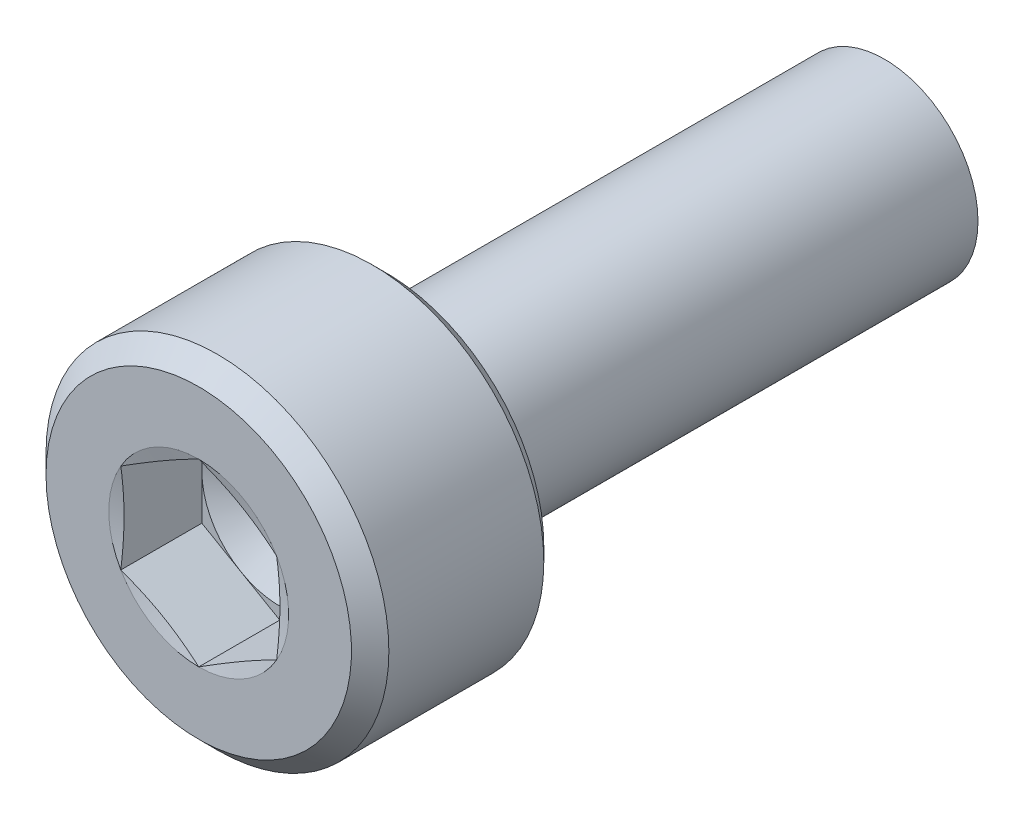
ISO-10303-21;
HEADER;
FILE_DESCRIPTION(('STEP AP214'),'2;1');
FILE_NAME('part.step','',(''),(''),'','','');
FILE_SCHEMA(('AUTOMOTIVE_DESIGN { 1 0 10303 214 1 1 1 1 }'));
ENDSEC;
DATA;
#1=APPLICATION_CONTEXT('core data for automotive mechanical design processes');
#2=APPLICATION_PROTOCOL_DEFINITION('international standard','automotive_design',2000,#1);
#3=PRODUCT_CONTEXT('',#1,'mechanical');
#4=PRODUCT('Part','Part','',(#3));
#5=PRODUCT_RELATED_PRODUCT_CATEGORY('part','',(#4));
#6=PRODUCT_DEFINITION_FORMATION('','',#4);
#7=PRODUCT_DEFINITION_CONTEXT('part definition',#1,'design');
#8=PRODUCT_DEFINITION('design','',#6,#7);
#9=PRODUCT_DEFINITION_SHAPE('','',#8);
#10=(LENGTH_UNIT() NAMED_UNIT(*) SI_UNIT(.MILLI.,.METRE.));
#11=(NAMED_UNIT(*) PLANE_ANGLE_UNIT() SI_UNIT($,.RADIAN.));
#12=(NAMED_UNIT(*) SI_UNIT($,.STERADIAN.) SOLID_ANGLE_UNIT());
#13=UNCERTAINTY_MEASURE_WITH_UNIT(LENGTH_MEASURE(1.E-05),#10,'distance_accuracy_value','');
#14=(GEOMETRIC_REPRESENTATION_CONTEXT(3) GLOBAL_UNCERTAINTY_ASSIGNED_CONTEXT((#13)) GLOBAL_UNIT_ASSIGNED_CONTEXT((#10,
#11,#12)) REPRESENTATION_CONTEXT('',''));
#15=CARTESIAN_POINT('',(0.,0.,0.));
#16=DIRECTION('',(0.,0.,1.));
#17=DIRECTION('',(1.,0.,0.));
#18=AXIS2_PLACEMENT_3D('',#15,#16,#17);
#19=CARTESIAN_POINT('',(1.25,0.721687836487033,-1.3));
#20=DIRECTION('',(0.5,0.866025403784439,0.));
#21=DIRECTION('',(0.,0.,-1.));
#22=AXIS2_PLACEMENT_3D('',#19,#20,#21);
#23=PLANE('',#22);
#24=CARTESIAN_POINT('',(0.,1.44337567297407,0.));
#25=CARTESIAN_POINT('',(0.0266010741574035,1.42801550344856,-0.00411563079121512));
#26=CARTESIAN_POINT('',(0.0532235716252887,1.41263958063488,-0.00803870308418439));
#27=CARTESIAN_POINT('',(0.105990950310015,1.38216656964672,-0.0153837682666469));
#28=CARTESIAN_POINT('',(0.132134938423043,1.36706993862756,-0.0188140917976724));
#29=CARTESIAN_POINT('',(0.184080896535333,1.33708618540438,-0.025174957981675));
#30=CARTESIAN_POINT('',(0.209882172940569,1.32219928511393,-0.0281121725270214));
#31=CARTESIAN_POINT('',(0.261290419336476,1.29254695927157,-0.0334872092687405));
#32=CARTESIAN_POINT('',(0.286897013202713,1.27778166527025,-0.0359293451582305));
#33=CARTESIAN_POINT('',(0.338814014231531,1.24779551622449,-0.0403875802559015));
#34=CARTESIAN_POINT('',(0.365124701320746,1.23257315304511,-0.0423903504078004));
#35=CARTESIAN_POINT('',(0.41739626342825,1.20233457949772,-0.0458161323987716));
#36=CARTESIAN_POINT('',(0.443356722749427,1.18731855544823,-0.0472470738867774));
#37=CARTESIAN_POINT('',(0.495189289691946,1.15738161600266,-0.0495320426407517));
#38=CARTESIAN_POINT('',(0.521061212339776,1.14246059341946,-0.0503888439825338));
#39=CARTESIAN_POINT('',(0.572960169546127,1.112545265764,-0.0515316995489692));
#40=CARTESIAN_POINT('',(0.598987292307348,1.09755099650677,-0.0518146703940937));
#41=CARTESIAN_POINT('',(0.651001958011103,1.06751871961563,-0.0518150403478976));
#42=CARTESIAN_POINT('',(0.676989512865152,1.0524807326171,-0.0515326731292534));
#43=CARTESIAN_POINT('',(0.728831950621195,1.02250093089559,-0.0503906133892446));
#44=CARTESIAN_POINT('',(0.754686839083206,1.00755901473306,-0.049533851076964));
#45=CARTESIAN_POINT('',(0.806530383134818,0.977641594560691,-0.0472488111413174));
#46=CARTESIAN_POINT('',(0.832519038985485,0.962666316501925,-0.0458176006639986));
#47=CARTESIAN_POINT('',(0.88485675257379,0.932508881624223,-0.0423912966395548));
#48=CARTESIAN_POINT('',(0.911205415535616,0.917326964095512,-0.0403881252485901));
#49=CARTESIAN_POINT('',(0.963136866609753,0.88735267068188,-0.035930182334875));
#50=CARTESIAN_POINT('',(0.988721142724691,0.872560833289737,-0.0334890493531678));
#51=CARTESIAN_POINT('',(1.04009703212967,0.842869124815658,-0.028115294806166));
#52=CARTESIAN_POINT('',(1.0658883492984,0.827969535565703,-0.0251782943883381));
#53=CARTESIAN_POINT('',(1.11782834522753,0.797976194945342,-0.0188173828427319));
#54=CARTESIAN_POINT('',(1.14397648287602,0.782882943312323,-0.0153867360503964));
#55=CARTESIAN_POINT('',(1.19675851906724,0.752418637222199,-0.0080404922123379));
#56=CARTESIAN_POINT('',(1.22339156591776,0.737048126643099,-0.00411650230644957));
#57=CARTESIAN_POINT('',(1.25,0.721687836487034,0.));
#58=B_SPLINE_CURVE_WITH_KNOTS('',3,(#24,#25,#26,#27,#28,#29,#30,#31,#32,#33,#34,#35,#36,#37,#38,
#39,#40,#41,#42,#43,#44,#45,#46,#47,#48,#49,#50,#51,#52,#53,#54,#55,#56,#57),.UNSPECIFIED.,.F.,
.F.,(4,2,2,2,2,2,2,2,2,2,2,2,2,2,2,2,4),(0.,0.0929756429984322,0.184124524266457,
0.273918330281164,0.362892504558264,0.454276274812247,0.544344744756976,0.633974830661911,
0.724085265734565,0.814158462912087,0.903775623702066,0.993856267691678,1.0852780295682,
1.17423384973417,1.26402077718908,1.35517544424662,1.44817056877235),.UNSPECIFIED.);
#59=CARTESIAN_POINT('',(0.,1.44337567297406,0.));
#60=VERTEX_POINT('',#59);
#61=CARTESIAN_POINT('',(1.25,0.721687836487034,0.));
#62=VERTEX_POINT('',#61);
#63=EDGE_CURVE('E263',#60,#62,#58,.T.);
#64=ORIENTED_EDGE('',*,*,#63,.F.);
#65=DIRECTION('',(0.,0.,1.));
#66=VECTOR('',#65,1.);
#67=CARTESIAN_POINT('',(0.,1.44337567297406,-1.3));
#68=LINE('',#67,#66);
#69=CARTESIAN_POINT('',(0.,1.44337567297406,-1.3));
#70=VERTEX_POINT('',#69);
#71=EDGE_CURVE('E367',#70,#60,#68,.T.);
#72=ORIENTED_EDGE('',*,*,#71,.F.);
#73=DIRECTION('',(-0.866025403784439,0.5,0.));
#74=VECTOR('',#73,1.);
#75=CARTESIAN_POINT('',(1.25,0.721687836487033,-1.3));
#76=LINE('',#75,#74);
#77=CARTESIAN_POINT('',(0.625,1.08253175473055,-1.3));
#78=VERTEX_POINT('',#77);
#79=EDGE_CURVE('E222',#78,#70,#76,.T.);
#80=ORIENTED_EDGE('',*,*,#79,.F.);
#81=DIRECTION('',(-0.866025403784439,0.5,0.));
#82=VECTOR('',#81,1.);
#83=CARTESIAN_POINT('',(1.25,0.721687836487033,-1.3));
#84=LINE('',#83,#82);
#85=CARTESIAN_POINT('',(1.25,0.721687836487033,-1.3));
#86=VERTEX_POINT('',#85);
#87=EDGE_CURVE('E238',#86,#78,#84,.T.);
#88=ORIENTED_EDGE('',*,*,#87,.F.);
#89=DIRECTION('',(0.,0.,1.));
#90=VECTOR('',#89,1.);
#91=CARTESIAN_POINT('',(1.25,0.721687836487033,-1.3));
#92=LINE('',#91,#90);
#93=EDGE_CURVE('E11',#86,#62,#92,.T.);
#94=ORIENTED_EDGE('',*,*,#93,.T.);
#95=EDGE_LOOP('',(#64,#72,#80,#88,#94));
#96=FACE_BOUND('',#95,.T.);
#97=ADVANCED_FACE('F45',(#96),#23,.F.);
#98=CARTESIAN_POINT('',(1.25,-0.721687836487033,-1.3));
#99=DIRECTION('',(1.,0.,0.));
#100=DIRECTION('',(0.,-1.,0.));
#101=AXIS2_PLACEMENT_3D('',#98,#99,#100);
#102=PLANE('',#101);
#103=CARTESIAN_POINT('',(1.25,0.721687836487034,0.));
#104=CARTESIAN_POINT('',(1.24999823698251,0.690999940764968,-0.0041116921545435));
#105=CARTESIAN_POINT('',(1.24999343638009,0.660285670486277,-0.0080312219209347));
#106=CARTESIAN_POINT('',(1.24998639785537,0.599409952891843,-0.0153701172192225));
#107=CARTESIAN_POINT('',(1.24998411141551,0.569249506080653,-0.0187977996777385));
#108=CARTESIAN_POINT('',(1.24998996305486,0.509329780508077,-0.0251543025812117));
#109=CARTESIAN_POINT('',(1.24999794646817,0.479571212976206,-0.0280897892747288));
#110=CARTESIAN_POINT('',(1.2500223367559,0.420283812845672,-0.0334622466755174));
#111=CARTESIAN_POINT('',(1.25003866580902,0.39075537251126,-0.0359035370987912));
#112=CARTESIAN_POINT('',(1.25002873622066,0.330797047066719,-0.0403659968356117));
#113=CARTESIAN_POINT('',(1.25000121650915,0.300366084889518,-0.0423727707061422));
#114=CARTESIAN_POINT('',(1.2499487716613,0.239913774778711,-0.0458055537624093));
#115=CARTESIAN_POINT('',(1.24992381469335,0.209892884574225,-0.0472395610352221));
#116=CARTESIAN_POINT('',(1.24991464001477,0.149977872401545,-0.0495283234961986));
#117=CARTESIAN_POINT('',(1.24993022107687,0.120083859273445,-0.0503859133498061));
#118=CARTESIAN_POINT('',(1.24996835071472,0.0601265989330451,-0.0515327901252948));
#119=CARTESIAN_POINT('',(1.24999093574578,0.030063293747345,-0.0518190439098863));
#120=CARTESIAN_POINT('',(1.25,0.,-0.0518148554092244));
#121=B_SPLINE_CURVE_WITH_KNOTS('',3,(#103,#104,#105,#106,#107,#108,#109,#110,#111,#112,#113,
#114,#115,#116,#117,#118,#119,#120),.UNSPECIFIED.,.F.,.F.,(4,2,2,2,2,2,2,2,4),(0.,
0.0928866686125054,0.18394754574854,0.273652950549812,0.362536731833363,0.454023240761691,
0.544183383798673,0.633896834523419,0.72408530693755),.UNSPECIFIED.);
#122=CARTESIAN_POINT('',(1.25,0.,-0.0518148554092244));
#123=VERTEX_POINT('',#122);
#124=EDGE_CURVE('E269',#62,#123,#121,.T.);
#125=ORIENTED_EDGE('',*,*,#124,.F.);
#126=ORIENTED_EDGE('',*,*,#93,.F.);
#127=DIRECTION('',(0.,1.,0.));
#128=VECTOR('',#127,1.);
#129=CARTESIAN_POINT('',(1.25,-0.721687836487033,-1.3));
#130=LINE('',#129,#128);
#131=CARTESIAN_POINT('',(1.25,0.,-1.3));
#132=VERTEX_POINT('',#131);
#133=EDGE_CURVE('E242',#132,#86,#130,.T.);
#134=ORIENTED_EDGE('',*,*,#133,.F.);
#135=DIRECTION('',(0.,1.,0.));
#136=VECTOR('',#135,1.);
#137=CARTESIAN_POINT('',(1.25,-0.721687836487033,-1.3));
#138=LINE('',#137,#136);
#139=CARTESIAN_POINT('',(1.25,-0.721687836487033,-1.3));
#140=VERTEX_POINT('',#139);
#141=EDGE_CURVE('E214',#140,#132,#138,.T.);
#142=ORIENTED_EDGE('',*,*,#141,.F.);
#143=DIRECTION('',(0.,0.,1.));
#144=VECTOR('',#143,1.);
#145=CARTESIAN_POINT('',(1.25,-0.721687836487033,-1.3));
#146=LINE('',#145,#144);
#147=CARTESIAN_POINT('',(1.25,-0.721687836487031,0.));
#148=VERTEX_POINT('',#147);
#149=EDGE_CURVE('E59',#140,#148,#146,.T.);
#150=ORIENTED_EDGE('',*,*,#149,.T.);
#151=CARTESIAN_POINT('',(1.25,0.,-0.0518148554092244));
#152=CARTESIAN_POINT('',(1.24999097697891,-0.0300388242332713,-0.0518190278008075));
#153=CARTESIAN_POINT('',(1.24996934760271,-0.0600776555269679,-0.0515329955368294));
#154=CARTESIAN_POINT('',(1.24993379974361,-0.119991561939784,-0.05038720494537));
#155=CARTESIAN_POINT('',(1.24991984260544,-0.149866692950213,-0.0495303717689572));
#156=CARTESIAN_POINT('',(1.24993183671915,-0.209749120653996,-0.0472437357421163));
#157=CARTESIAN_POINT('',(1.24995799405163,-0.239756304838218,-0.0458110022567921));
#158=CARTESIAN_POINT('',(1.25001075989497,-0.300186021092445,-0.0423815066628743));
#159=CARTESIAN_POINT('',(1.25003736932907,-0.330608091422305,-0.040376671117203));
#160=CARTESIAN_POINT('',(1.2500446486428,-0.39057222202749,-0.0359167393057105));
#161=CARTESIAN_POINT('',(1.25002656990743,-0.420115329127233,-0.0334756444191961));
#162=CARTESIAN_POINT('',(1.24999981108288,-0.479432961970562,-0.0281026849191924));
#163=CARTESIAN_POINT('',(1.24999121968782,-0.509207093749055,-0.0251664799491732));
#164=CARTESIAN_POINT('',(1.24998452367544,-0.569159340782016,-0.0188078031597437));
#165=CARTESIAN_POINT('',(1.24998657991599,-0.599336742030467,-0.0153786379059865));
#166=CARTESIAN_POINT('',(1.24999338873797,-0.660248180215888,-0.00803601627135115));
#167=CARTESIAN_POINT('',(1.24999819468793,-0.690981212849153,-0.0041142106816611));
#168=CARTESIAN_POINT('',(1.25,-0.72168783648703,0.));
#169=B_SPLINE_CURVE_WITH_KNOTS('',3,(#151,#152,#153,#154,#155,#156,#157,#158,#159,#160,#161,
#162,#163,#164,#165,#166,#167,#168),.UNSPECIFIED.,.F.,.F.,(4,2,2,2,2,2,2,2,4),(0.,
0.0901150585143207,0.179771826003305,0.26989073371865,0.361350251095626,0.450277827988882,
0.540029901554553,0.631141813166489,0.72408517261877),.UNSPECIFIED.);
#170=EDGE_CURVE('E489',#123,#148,#169,.T.);
#171=ORIENTED_EDGE('',*,*,#170,.F.);
#172=EDGE_LOOP('',(#125,#126,#134,#142,#150,#171));
#173=FACE_BOUND('',#172,.T.);
#174=ADVANCED_FACE('F446',(#173),#102,.F.);
#175=CARTESIAN_POINT('',(0.,-1.44337567297406,-1.3));
#176=DIRECTION('',(0.5,-0.866025403784439,0.));
#177=DIRECTION('',(0.,0.,-1.));
#178=AXIS2_PLACEMENT_3D('',#175,#176,#177);
#179=PLANE('',#178);
#180=CARTESIAN_POINT('',(1.25,-0.72168783648703,0.));
#181=CARTESIAN_POINT('',(1.2233971659058,-0.737044957712528,-0.00411563079121149));
#182=CARTESIAN_POINT('',(1.19676997740861,-0.752412755425053,-0.00803870308417673));
#183=CARTESIAN_POINT('',(1.14399588642073,-0.782874140363045,-0.0153837682666341));
#184=CARTESIAN_POINT('',(1.11784982639007,-0.797967182715585,-0.018814091797658));
#185=CARTESIAN_POINT('',(1.06591015534185,-0.827961825453168,-0.0251749579816608));
#186=CARTESIAN_POINT('',(1.04011708330409,-0.842862936124947,-0.0281121725270084));
#187=CARTESIAN_POINT('',(0.988733292645323,-0.872557620546649,-0.0334872092687323));
#188=CARTESIAN_POINT('',(0.963142876012687,-0.88735093433855,-0.0359293451582256));
#189=CARTESIAN_POINT('',(0.91121560866282,-0.917319301594997,-0.0403875802559157));
#190=CARTESIAN_POINT('',(0.884877311899103,-0.932493843415649,-0.0423903504078287));
#191=CARTESIAN_POINT('',(0.832554157978914,-0.962643057322603,-0.0458161323988174));
#192=CARTESIAN_POINT('',(0.806569670027579,-0.977617462563912,-0.0472470738868286));
#193=CARTESIAN_POINT('',(0.754727236484892,-1.00753731255668,-0.0495320426408034));
#194=CARTESIAN_POINT('',(0.728869290553528,-1.02248254352281,-0.0503888439825823));
#195=CARTESIAN_POINT('',(0.677012378238376,-1.05247069506564,-0.0515316995489991));
#196=CARTESIAN_POINT('',(0.651013398769965,-1.06751370993562,-0.0518146703941098));
#197=CARTESIAN_POINT('',(0.598997351197246,-1.09754359335878,-0.051815040347882));
#198=CARTESIAN_POINT('',(0.57298029500795,-1.11253048254531,-0.0515326731292214));
#199=CARTESIAN_POINT('',(0.521095806239011,-1.14243744977536,-0.0503906133891943));
#200=CARTESIAN_POINT('',(0.495228283030122,-1.15735748191422,-0.0495338510769088));
#201=CARTESIAN_POINT('',(0.443397265119366,-1.18729659799899,-0.0472488111412611));
#202=CARTESIAN_POINT('',(0.417433965966339,-1.20231579514653,-0.0458176006639436));
#203=CARTESIAN_POINT('',(0.365148004454804,-1.2325628672512,-0.0423912966395229));
#204=CARTESIAN_POINT('',(0.338825746715614,-1.24779051996754,-0.0403881252485777));
#205=CARTESIAN_POINT('',(0.28690152162188,-1.27777732914604,-0.0359301823349323));
#206=CARTESIAN_POINT('',(0.261299276614448,-1.29253804350266,-0.0334890493532856));
#207=CARTESIAN_POINT('',(0.209897558092061,-1.32218501463202,-0.0281152948063626));
#208=CARTESIAN_POINT('',(0.184098476711416,-1.33707115587218,-0.025178294388549));
#209=CARTESIAN_POINT('',(0.13215348382532,-1.36705584150914,-0.0188173828429405));
#210=CARTESIAN_POINT('',(0.106008275661093,-1.38215416715798,-0.0153867360505843));
#211=CARTESIAN_POINT('',(0.0532343945823571,-1.41263259831833,-0.00804049221245096));
#212=CARTESIAN_POINT('',(0.0266066185261265,-1.42801223818175,-0.00411650230650442));
#213=CARTESIAN_POINT('',(0.,-1.44337567297406,0.));
#214=B_SPLINE_CURVE_WITH_KNOTS('',3,(#180,#181,#182,#183,#184,#185,#186,#187,#188,#189,#190,
#191,#192,#193,#194,#195,#196,#197,#198,#199,#200,#201,#202,#203,#204,#205,#206,#207,#208,#209,
#210,#211,#212,#213),.UNSPECIFIED.,.F.,.F.,(4,2,2,2,2,2,2,2,2,2,2,2,2,2,2,2,4),(0.,
0.0929756429983488,0.18412452426635,0.273918330281088,0.362892504558272,0.454276274812701,
0.544344744757564,0.633974830662343,0.72408526573457,0.814158462911407,0.903775623701171,
0.993856267691015,1.0852780295682,1.17423384973301,1.26402077718748,1.3551754442454,
1.44817056877235),.UNSPECIFIED.);
#215=CARTESIAN_POINT('',(0.,-1.44337567297406,0.));
#216=VERTEX_POINT('',#215);
#217=EDGE_CURVE('E431',#148,#216,#214,.T.);
#218=ORIENTED_EDGE('',*,*,#217,.F.);
#219=ORIENTED_EDGE('',*,*,#149,.F.);
#220=DIRECTION('',(0.866025403784439,0.5,0.));
#221=VECTOR('',#220,1.);
#222=CARTESIAN_POINT('',(0.,-1.44337567297406,-1.3));
#223=LINE('',#222,#221);
#224=CARTESIAN_POINT('',(0.625,-1.08253175473055,-1.3));
#225=VERTEX_POINT('',#224);
#226=EDGE_CURVE('E217',#225,#140,#223,.T.);
#227=ORIENTED_EDGE('',*,*,#226,.F.);
#228=DIRECTION('',(0.866025403784439,0.5,0.));
#229=VECTOR('',#228,1.);
#230=CARTESIAN_POINT('',(0.,-1.44337567297406,-1.3));
#231=LINE('',#230,#229);
#232=CARTESIAN_POINT('',(0.,-1.44337567297406,-1.3));
#233=VERTEX_POINT('',#232);
#234=EDGE_CURVE('E205',#233,#225,#231,.T.);
#235=ORIENTED_EDGE('',*,*,#234,.F.);
#236=DIRECTION('',(0.,0.,1.));
#237=VECTOR('',#236,1.);
#238=CARTESIAN_POINT('',(0.,-1.44337567297406,-1.3));
#239=LINE('',#238,#237);
#240=EDGE_CURVE('E366',#233,#216,#239,.T.);
#241=ORIENTED_EDGE('',*,*,#240,.T.);
#242=EDGE_LOOP('',(#218,#219,#227,#235,#241));
#243=FACE_BOUND('',#242,.T.);
#244=ADVANCED_FACE('F437',(#243),#179,.F.);
#245=CARTESIAN_POINT('',(-1.25,-0.721687836487032,-1.3));
#246=DIRECTION('',(-0.5,-0.866025403784439,0.));
#247=DIRECTION('',(-0.866025403784439,0.5,0.));
#248=AXIS2_PLACEMENT_3D('',#245,#246,#247);
#249=PLANE('',#248);
#250=CARTESIAN_POINT('',(0.,-1.44337567297406,0.));
#251=CARTESIAN_POINT('',(-0.0266010741573072,-1.42801550344862,-0.00411563079120053));
#252=CARTESIAN_POINT('',(-0.0532235716251028,-1.412639580635,-0.00803870308415418));
#253=CARTESIAN_POINT('',(-0.105990950309719,-1.38216656964693,-0.0153837682665966));
#254=CARTESIAN_POINT('',(-0.132134938422726,-1.3670699386278,-0.0188140917976166));
#255=CARTESIAN_POINT('',(-0.184080896535033,-1.33708618540464,-0.0251749579816186));
#256=CARTESIAN_POINT('',(-0.209882172940307,-1.32219928511417,-0.0281121725269688));
#257=CARTESIAN_POINT('',(-0.261290419336326,-1.29254695927172,-0.0334872092687093));
#258=CARTESIAN_POINT('',(-0.286897013202638,-1.27778166527032,-0.0359293451582158));
#259=CARTESIAN_POINT('',(-0.338814014231424,-1.24779551622451,-0.0403875802559013));
#260=CARTESIAN_POINT('',(-0.365124701320532,-1.23257315304517,-0.0423903504078018));
#261=CARTESIAN_POINT('',(-0.417396263427902,-1.20233457949783,-0.0458161323987747));
#262=CARTESIAN_POINT('',(-0.443356722749052,-1.18731855544836,-0.0472470738867794));
#263=CARTESIAN_POINT('',(-0.495189289691583,-1.15738161600281,-0.0495320426407528));
#264=CARTESIAN_POINT('',(-0.521061212339452,-1.14246059341961,-0.0503888439825337));
#265=CARTESIAN_POINT('',(-0.572960169545936,-1.11254526576409,-0.0515316995489712));
#266=CARTESIAN_POINT('',(-0.59898729230725,-1.09755099650681,-0.0518146703940977));
#267=CARTESIAN_POINT('',(-0.651001958010772,-1.06751871961583,-0.0518150403478942));
#268=CARTESIAN_POINT('',(-0.676989512864494,-1.05248073261752,-0.0515326731292499));
#269=CARTESIAN_POINT('',(-0.728831950620127,-1.02250093089636,-0.0503906133892435));
#270=CARTESIAN_POINT('',(-0.754686839082053,-1.00755901473394,-0.0495338510769603));
#271=CARTESIAN_POINT('',(-0.806530383133706,-0.97764159456164,-0.0472488111413116));
#272=CARTESIAN_POINT('',(-0.832519038984498,-0.962666316502832,-0.0458176006639886));
#273=CARTESIAN_POINT('',(-0.884856752573216,-0.932508881624801,-0.0423912966395508));
#274=CARTESIAN_POINT('',(-0.911205415535328,-0.917326964095802,-0.0403881252485919));
#275=CARTESIAN_POINT('',(-0.963136866609371,-0.887352670681979,-0.0359301823349303));
#276=CARTESIAN_POINT('',(-0.98872114272393,-0.872560833289935,-0.0334890493532837));
#277=CARTESIAN_POINT('',(-1.04009703212842,-0.842869124816045,-0.0281152948063605));
#278=CARTESIAN_POINT('',(-1.06588834929704,-0.827969535566183,-0.0251782943885465));
#279=CARTESIAN_POINT('',(-1.11782834522619,-0.797976194945903,-0.0188173828429378));
#280=CARTESIAN_POINT('',(-1.1439764828748,-0.782882943312871,-0.0153867360505819));
#281=CARTESIAN_POINT('',(-1.19675851906652,-0.752418637222568,-0.00804049221244955));
#282=CARTESIAN_POINT('',(-1.22339156591741,-0.7370481266433,-0.00411650230650377));
#283=CARTESIAN_POINT('',(-1.25,-0.721687836487036,0.));
#284=B_SPLINE_CURVE_WITH_KNOTS('',3,(#250,#251,#252,#253,#254,#255,#256,#257,#258,#259,#260,
#261,#262,#263,#264,#265,#266,#267,#268,#269,#270,#271,#272,#273,#274,#275,#276,#277,#278,#279,
#280,#281,#282,#283),.UNSPECIFIED.,.F.,.F.,(4,2,2,2,2,2,2,2,2,2,2,2,2,2,2,2,4),(0.,
0.0929756429981014,0.184124524266029,0.273918330280853,0.362892504558266,0.454276274811929,
0.544344744756552,0.633974830661595,0.724085265734569,0.814158462910913,0.9037756237005,
0.993856267690502,1.0852780295682,1.17423384973303,1.2640207771875,1.35517544424541,
1.44817056877234),.UNSPECIFIED.);
#285=CARTESIAN_POINT('',(-1.25,-0.721687836487033,0.));
#286=VERTEX_POINT('',#285);
#287=EDGE_CURVE('E353',#216,#286,#284,.T.);
#288=ORIENTED_EDGE('',*,*,#287,.F.);
#289=ORIENTED_EDGE('',*,*,#240,.F.);
#290=DIRECTION('',(0.866025403784439,-0.5,0.));
#291=VECTOR('',#290,1.);
#292=CARTESIAN_POINT('',(-1.25,-0.721687836487032,-1.3));
#293=LINE('',#292,#291);
#294=CARTESIAN_POINT('',(-0.625,-1.08253175473055,-1.3));
#295=VERTEX_POINT('',#294);
#296=EDGE_CURVE('E190',#295,#233,#293,.T.);
#297=ORIENTED_EDGE('',*,*,#296,.F.);
#298=DIRECTION('',(0.866025403784439,-0.5,0.));
#299=VECTOR('',#298,1.);
#300=CARTESIAN_POINT('',(-1.25,-0.721687836487032,-1.3));
#301=LINE('',#300,#299);
#302=CARTESIAN_POINT('',(-1.25,-0.721687836487032,-1.3));
#303=VERTEX_POINT('',#302);
#304=EDGE_CURVE('E204',#303,#295,#301,.T.);
#305=ORIENTED_EDGE('',*,*,#304,.F.);
#306=DIRECTION('',(0.,0.,1.));
#307=VECTOR('',#306,1.);
#308=CARTESIAN_POINT('',(-1.25,-0.721687836487032,-1.3));
#309=LINE('',#308,#307);
#310=EDGE_CURVE('E358',#303,#286,#309,.T.);
#311=ORIENTED_EDGE('',*,*,#310,.T.);
#312=EDGE_LOOP('',(#288,#289,#297,#305,#311));
#313=FACE_BOUND('',#312,.T.);
#314=ADVANCED_FACE('F335',(#313),#249,.F.);
#315=CARTESIAN_POINT('',(-1.25,0.721687836487033,-1.3));
#316=DIRECTION('',(-1.,0.,0.));
#317=DIRECTION('',(0.,0.,1.));
#318=AXIS2_PLACEMENT_3D('',#315,#316,#317);
#319=PLANE('',#318);
#320=CARTESIAN_POINT('',(-1.25,-0.721687836487036,0.));
#321=CARTESIAN_POINT('',(-1.24999821886412,-0.690932210000902,-0.00412077366792503));
#322=CARTESIAN_POINT('',(-1.24999387857277,-0.660150074866336,-0.00804841753616333));
#323=CARTESIAN_POINT('',(-1.24998827175687,-0.599138517352571,-0.0154014380852009));
#324=CARTESIAN_POINT('',(-1.24998694660483,-0.568910098118886,-0.0188351562390941));
#325=CARTESIAN_POINT('',(-1.24999480562822,-0.508853302588297,-0.0252016317976271));
#326=CARTESIAN_POINT('',(-1.25000383433192,-0.479025637483938,-0.0281410598390331));
#327=CARTESIAN_POINT('',(-1.25002969465079,-0.419597741693308,-0.0335193354014606));
#328=CARTESIAN_POINT('',(-1.25004645478338,-0.389997900664602,-0.0359624795469015));
#329=CARTESIAN_POINT('',(-1.25003624698015,-0.329932451723906,-0.0404235084844104));
#330=CARTESIAN_POINT('',(-1.25000804135667,-0.299465811483142,-0.0424275685535516));
#331=CARTESIAN_POINT('',(-1.24995480282112,-0.238942721030509,-0.0458531334643784));
#332=CARTESIAN_POINT('',(-1.24992972983623,-0.208886728419523,-0.0472826637209089));
#333=CARTESIAN_POINT('',(-1.24991813207592,-0.148900847883205,-0.0495620346762597));
#334=CARTESIAN_POINT('',(-1.24993141807717,-0.11897106783738,-0.0504146953997261));
#335=CARTESIAN_POINT('',(-1.24997269319909,-0.0589403752630816,-0.0515465360951228));
#336=CARTESIAN_POINT('',(-1.25000076068601,-0.0288394047107543,-0.0518226201453485));
#337=CARTESIAN_POINT('',(-1.24999924183589,0.0312625879908033,-0.051806775859687));
#338=CARTESIAN_POINT('',(-1.24996984632998,0.0612636106529509,-0.051516727619696));
#339=CARTESIAN_POINT('',(-1.24992780073287,0.121103798973637,-0.0503604178239));
#340=CARTESIAN_POINT('',(-1.24991506723406,0.150943020383787,-0.049497059210113));
#341=CARTESIAN_POINT('',(-1.24992723273208,0.21075428356878,-0.0471998946158216));
#342=CARTESIAN_POINT('',(-1.2499523271874,0.240726211851809,-0.0457631542002465));
#343=CARTESIAN_POINT('',(-1.25000360417568,0.301084835090529,-0.0423268298904389));
#344=CARTESIAN_POINT('',(-1.25002979734107,0.331471068197909,-0.0403191918787037));
#345=CARTESIAN_POINT('',(-1.25003699758531,0.391328089389752,-0.0358577918245045));
#346=CARTESIAN_POINT('',(-1.25001928795661,0.42079996858613,-0.0334185904444356));
#347=CARTESIAN_POINT('',(-1.24999394681244,0.479977430952503,-0.0280514827152005));
#348=CARTESIAN_POINT('',(-1.24998641124457,0.509682617587425,-0.0251192130216116));
#349=CARTESIAN_POINT('',(-1.24998172156504,0.569498085241384,-0.0187704983671833));
#350=CARTESIAN_POINT('',(-1.24998472717054,0.599607652246593,-0.0153473647873735));
#351=CARTESIAN_POINT('',(-1.2499929474011,0.660383517909659,-0.00801885284655767));
#352=CARTESIAN_POINT('',(-1.24999820530047,0.691048814920108,-0.00410514993995136));
#353=CARTESIAN_POINT('',(-1.25,0.721687836487032,0.));
#354=B_SPLINE_CURVE_WITH_KNOTS('',3,(#320,#321,#322,#323,#324,#325,#326,#327,#328,#329,#330,
#331,#332,#333,#334,#335,#336,#337,#338,#339,#340,#341,#342,#343,#344,#345,#346,#347,#348,#349,
#350,#351,#352,#353),.UNSPECIFIED.,.F.,.F.,(4,2,2,2,2,2,2,2,2,2,2,2,2,2,2,2,4),(0.,
0.0930916808948182,0.184357193016995,0.274270023536689,0.363367712388216,0.454960459263653,
0.545225160616974,0.635045351768193,0.725346604253175,0.815348481166214,0.904898075925872,
0.994911965590393,1.0862647637543,1.17497894838529,1.26452405113569,1.35543174170835,
1.44817047837161),.UNSPECIFIED.);
#355=CARTESIAN_POINT('',(-1.25,0.721687836487033,0.));
#356=VERTEX_POINT('',#355);
#357=EDGE_CURVE('E381',#286,#356,#354,.T.);
#358=ORIENTED_EDGE('',*,*,#357,.F.);
#359=ORIENTED_EDGE('',*,*,#310,.F.);
#360=DIRECTION('',(0.,-1.,0.));
#361=VECTOR('',#360,1.);
#362=CARTESIAN_POINT('',(-1.25,0.721687836487033,-1.3));
#363=LINE('',#362,#361);
#364=CARTESIAN_POINT('',(-1.25,0.,-1.3));
#365=VERTEX_POINT('',#364);
#366=EDGE_CURVE('E200',#365,#303,#363,.T.);
#367=ORIENTED_EDGE('',*,*,#366,.F.);
#368=DIRECTION('',(0.,-1.,0.));
#369=VECTOR('',#368,1.);
#370=CARTESIAN_POINT('',(-1.25,0.721687836487033,-1.3));
#371=LINE('',#370,#369);
#372=CARTESIAN_POINT('',(-1.25,0.721687836487033,-1.3));
#373=VERTEX_POINT('',#372);
#374=EDGE_CURVE('E196',#373,#365,#371,.T.);
#375=ORIENTED_EDGE('',*,*,#374,.F.);
#376=DIRECTION('',(0.,0.,1.));
#377=VECTOR('',#376,1.);
#378=CARTESIAN_POINT('',(-1.25,0.721687836487033,-1.3));
#379=LINE('',#378,#377);
#380=EDGE_CURVE('E72',#373,#356,#379,.T.);
#381=ORIENTED_EDGE('',*,*,#380,.T.);
#382=EDGE_LOOP('',(#358,#359,#367,#375,#381));
#383=FACE_BOUND('',#382,.T.);
#384=ADVANCED_FACE('F397',(#383),#319,.F.);
#385=CARTESIAN_POINT('',(0.,1.44337567297406,-1.3));
#386=DIRECTION('',(-0.5,0.866025403784439,0.));
#387=DIRECTION('',(0.,0.,1.));
#388=AXIS2_PLACEMENT_3D('',#385,#386,#387);
#389=PLANE('',#388);
#390=CARTESIAN_POINT('',(-1.25,0.721687836487032,0.));
#391=CARTESIAN_POINT('',(-1.22339716590584,0.737044957712511,-0.00411563079120637));
#392=CARTESIAN_POINT('',(-1.19676997740868,0.752412755425021,-0.00803870308416613));
#393=CARTESIAN_POINT('',(-1.14399588642084,0.782874140362995,-0.0153837682666164));
#394=CARTESIAN_POINT('',(-1.1178498263902,0.797967182715534,-0.0188140917976384));
#395=CARTESIAN_POINT('',(-1.06591015534198,0.827961825453124,-0.0251749579816409));
#396=CARTESIAN_POINT('',(-1.04011708330421,0.842862936124911,-0.0281121725269898));
#397=CARTESIAN_POINT('',(-0.988733292645396,0.87255762054663,-0.0334872092687212));
#398=CARTESIAN_POINT('',(-0.963142876012725,0.887350934338539,-0.0359293451582203));
#399=CARTESIAN_POINT('',(-0.911215608662851,0.917319301594967,-0.0403875802559155));
#400=CARTESIAN_POINT('',(-0.884877311899161,0.932493843415591,-0.042390350407829));
#401=CARTESIAN_POINT('',(-0.832554157979012,0.962643057322515,-0.0458161323988182));
#402=CARTESIAN_POINT('',(-0.806569670027688,0.97761746256382,-0.0472470738868289));
#403=CARTESIAN_POINT('',(-0.754727236485004,1.00753731255659,-0.0495320426408036));
#404=CARTESIAN_POINT('',(-0.728869290553631,1.02248254352274,-0.0503888439825824));
#405=CARTESIAN_POINT('',(-0.677012378238439,1.0524706950656,-0.0515316995489988));
#406=CARTESIAN_POINT('',(-0.651013398769998,1.06751370993561,-0.0518146703941088));
#407=CARTESIAN_POINT('',(-0.598997351197131,1.09754359335884,-0.0518150403478823));
#408=CARTESIAN_POINT('',(-0.572980295007719,1.11253048254543,-0.0515326731292221));
#409=CARTESIAN_POINT('',(-0.521095806238615,1.14243744977554,-0.0503906133891946));
#410=CARTESIAN_POINT('',(-0.49522828302968,1.1573574819144,-0.0495338510769098));
#411=CARTESIAN_POINT('',(-0.443397265118909,1.18729659799915,-0.0472488111412628));
#412=CARTESIAN_POINT('',(-0.417433965965914,1.20231579514667,-0.0458176006639467));
#413=CARTESIAN_POINT('',(-0.365148004454539,1.23256286725127,-0.042391296639524));
#414=CARTESIAN_POINT('',(-0.338825746715477,1.24779051996758,-0.0403881252485769));
#415=CARTESIAN_POINT('',(-0.286901521621781,1.27777732914614,-0.0359301823349139));
#416=CARTESIAN_POINT('',(-0.261299276614258,1.29253804350285,-0.0334890493532472));
#417=CARTESIAN_POINT('',(-0.209897558091737,1.32218501463232,-0.0281152948062984));
#418=CARTESIAN_POINT('',(-0.184098476711047,1.33707115587249,-0.0251782943884803));
#419=CARTESIAN_POINT('',(-0.132153483824933,1.36705584150943,-0.0188173828428726));
#420=CARTESIAN_POINT('',(-0.106008275660732,1.38215416715824,-0.0153867360505231));
#421=CARTESIAN_POINT('',(-0.0532343945821315,1.41263259831848,-0.00804049221241403));
#422=CARTESIAN_POINT('',(-0.0266066185260098,1.42801223818181,-0.00411650230648636));
#423=CARTESIAN_POINT('',(0.,1.44337567297407,0.));
#424=B_SPLINE_CURVE_WITH_KNOTS('',3,(#390,#391,#392,#393,#394,#395,#396,#397,#398,#399,#400,
#401,#402,#403,#404,#405,#406,#407,#408,#409,#410,#411,#412,#413,#414,#415,#416,#417,#418,#419,
#420,#421,#422,#423),.UNSPECIFIED.,.F.,.F.,(4,2,2,2,2,2,2,2,2,2,2,2,2,2,2,2,4),(0.,
0.0929756429982334,0.1841245242662,0.273918330280977,0.362892504558266,0.454276274812582,
0.54434474475741,0.633974830662229,0.72408526573457,0.814158462911794,0.903775623701688,
0.993856267691406,1.08527802956821,1.17423384973339,1.264020777188,1.3551754442458,
1.44817056877235),.UNSPECIFIED.);
#425=EDGE_CURVE('E474',#356,#60,#424,.T.);
#426=ORIENTED_EDGE('',*,*,#425,.F.);
#427=ORIENTED_EDGE('',*,*,#380,.F.);
#428=DIRECTION('',(-0.866025403784439,-0.5,0.));
#429=VECTOR('',#428,1.);
#430=CARTESIAN_POINT('',(0.,1.44337567297406,-1.3));
#431=LINE('',#430,#429);
#432=CARTESIAN_POINT('',(-0.625,1.08253175473055,-1.3));
#433=VERTEX_POINT('',#432);
#434=EDGE_CURVE('E199',#433,#373,#431,.T.);
#435=ORIENTED_EDGE('',*,*,#434,.F.);
#436=DIRECTION('',(-0.866025403784439,-0.5,0.));
#437=VECTOR('',#436,1.);
#438=CARTESIAN_POINT('',(0.,1.44337567297406,-1.3));
#439=LINE('',#438,#437);
#440=EDGE_CURVE('E218',#70,#433,#439,.T.);
#441=ORIENTED_EDGE('',*,*,#440,.F.);
#442=ORIENTED_EDGE('',*,*,#71,.T.);
#443=EDGE_LOOP('',(#426,#427,#435,#441,#442));
#444=FACE_BOUND('',#443,.T.);
#445=ADVANCED_FACE('F320',(#444),#389,.F.);
#446=CARTESIAN_POINT('',(0.,0.,-1.3));
#447=DIRECTION('',(0.,0.,1.));
#448=DIRECTION('',(1.,0.,0.));
#449=AXIS2_PLACEMENT_3D('',#446,#447,#448);
#450=PLANE('',#449);
#451=CARTESIAN_POINT('',(0.,0.,-1.3));
#452=DIRECTION('',(0.,0.,1.));
#453=DIRECTION('',(1.,0.,0.));
#454=AXIS2_PLACEMENT_3D('',#451,#452,#453);
#455=CIRCLE('',#454,1.25);
#456=EDGE_CURVE('E233',#433,#365,#455,.T.);
#457=ORIENTED_EDGE('',*,*,#456,.F.);
#458=ORIENTED_EDGE('',*,*,#434,.T.);
#459=ORIENTED_EDGE('',*,*,#374,.T.);
#460=EDGE_LOOP('',(#457,#458,#459));
#461=FACE_BOUND('',#460,.T.);
#462=ADVANCED_FACE('F316',(#461),#450,.T.);
#463=CARTESIAN_POINT('',(0.,0.,-1.3));
#464=DIRECTION('',(0.,0.,1.));
#465=DIRECTION('',(1.,0.,0.));
#466=AXIS2_PLACEMENT_3D('',#463,#464,#465);
#467=PLANE('',#466);
#468=CARTESIAN_POINT('',(0.,0.,-1.3));
#469=DIRECTION('',(0.,0.,1.));
#470=DIRECTION('',(1.,0.,0.));
#471=AXIS2_PLACEMENT_3D('',#468,#469,#470);
#472=CIRCLE('',#471,1.25);
#473=EDGE_CURVE('E210',#78,#433,#472,.T.);
#474=ORIENTED_EDGE('',*,*,#473,.F.);
#475=ORIENTED_EDGE('',*,*,#79,.T.);
#476=ORIENTED_EDGE('',*,*,#440,.T.);
#477=EDGE_LOOP('',(#474,#475,#476));
#478=FACE_BOUND('',#477,.T.);
#479=ADVANCED_FACE('F312',(#478),#467,.T.);
#480=CARTESIAN_POINT('',(0.,0.,-1.3));
#481=DIRECTION('',(0.,0.,1.));
#482=DIRECTION('',(1.,0.,0.));
#483=AXIS2_PLACEMENT_3D('',#480,#481,#482);
#484=PLANE('',#483);
#485=CARTESIAN_POINT('',(0.,0.,-1.3));
#486=DIRECTION('',(0.,0.,1.));
#487=DIRECTION('',(1.,0.,0.));
#488=AXIS2_PLACEMENT_3D('',#485,#486,#487);
#489=CIRCLE('',#488,1.25);
#490=EDGE_CURVE('E227',#365,#295,#489,.T.);
#491=ORIENTED_EDGE('',*,*,#490,.F.);
#492=ORIENTED_EDGE('',*,*,#366,.T.);
#493=ORIENTED_EDGE('',*,*,#304,.T.);
#494=EDGE_LOOP('',(#491,#492,#493));
#495=FACE_BOUND('',#494,.T.);
#496=ADVANCED_FACE('F315',(#495),#484,.T.);
#497=CARTESIAN_POINT('',(0.,0.,-1.3));
#498=DIRECTION('',(0.,0.,1.));
#499=DIRECTION('',(1.,0.,0.));
#500=AXIS2_PLACEMENT_3D('',#497,#498,#499);
#501=PLANE('',#500);
#502=CARTESIAN_POINT('',(0.,0.,-1.3));
#503=DIRECTION('',(0.,0.,1.));
#504=DIRECTION('',(1.,0.,0.));
#505=AXIS2_PLACEMENT_3D('',#502,#503,#504);
#506=CIRCLE('',#505,1.25);
#507=EDGE_CURVE('E223',#295,#225,#506,.T.);
#508=ORIENTED_EDGE('',*,*,#507,.F.);
#509=ORIENTED_EDGE('',*,*,#296,.T.);
#510=ORIENTED_EDGE('',*,*,#234,.T.);
#511=EDGE_LOOP('',(#508,#509,#510));
#512=FACE_BOUND('',#511,.T.);
#513=ADVANCED_FACE('F325',(#512),#501,.T.);
#514=CARTESIAN_POINT('',(0.,0.,-1.3));
#515=DIRECTION('',(0.,0.,1.));
#516=DIRECTION('',(1.,0.,0.));
#517=AXIS2_PLACEMENT_3D('',#514,#515,#516);
#518=PLANE('',#517);
#519=CARTESIAN_POINT('',(0.,0.,-1.3));
#520=DIRECTION('',(0.,0.,1.));
#521=DIRECTION('',(1.,0.,0.));
#522=AXIS2_PLACEMENT_3D('',#519,#520,#521);
#523=CIRCLE('',#522,1.25);
#524=EDGE_CURVE('E211',#225,#132,#523,.T.);
#525=ORIENTED_EDGE('',*,*,#524,.F.);
#526=ORIENTED_EDGE('',*,*,#226,.T.);
#527=ORIENTED_EDGE('',*,*,#141,.T.);
#528=EDGE_LOOP('',(#525,#526,#527));
#529=FACE_BOUND('',#528,.T.);
#530=ADVANCED_FACE('F322',(#529),#518,.T.);
#531=CARTESIAN_POINT('',(0.,0.,-1.3));
#532=DIRECTION('',(0.,0.,1.));
#533=DIRECTION('',(1.,0.,0.));
#534=AXIS2_PLACEMENT_3D('',#531,#532,#533);
#535=PLANE('',#534);
#536=CARTESIAN_POINT('',(0.,0.,-1.3));
#537=DIRECTION('',(0.,0.,1.));
#538=DIRECTION('',(1.,0.,0.));
#539=AXIS2_PLACEMENT_3D('',#536,#537,#538);
#540=CIRCLE('',#539,1.25);
#541=EDGE_CURVE('E206',#132,#78,#540,.T.);
#542=ORIENTED_EDGE('',*,*,#541,.F.);
#543=ORIENTED_EDGE('',*,*,#133,.T.);
#544=ORIENTED_EDGE('',*,*,#87,.T.);
#545=EDGE_LOOP('',(#542,#543,#544));
#546=FACE_BOUND('',#545,.T.);
#547=ADVANCED_FACE('F293',(#546),#535,.T.);
#548=CARTESIAN_POINT('',(0.,0.,-0.0518148554092243));
#549=DIRECTION('',(0.,0.,1.));
#550=DIRECTION('',(1.,0.,0.));
#551=AXIS2_PLACEMENT_3D('',#548,#549,#550);
#552=CONICAL_SURFACE('',#551,1.25,1.30899693899575);
#553=ORIENTED_EDGE('',*,*,#63,.T.);
#554=CARTESIAN_POINT('',(0.,0.,0.));
#555=DIRECTION('',(0.,0.,1.));
#556=DIRECTION('',(1.,0.,0.));
#557=AXIS2_PLACEMENT_3D('',#554,#555,#556);
#558=CIRCLE('',#557,1.44337567297406);
#559=EDGE_CURVE('E536',#62,#60,#558,.T.);
#560=ORIENTED_EDGE('',*,*,#559,.T.);
#561=EDGE_LOOP('',(#553,#560));
#562=FACE_BOUND('',#561,.T.);
#563=ADVANCED_FACE('F282',(#562),#552,.F.);
#564=CARTESIAN_POINT('',(0.,0.,-0.0518148554092243));
#565=DIRECTION('',(0.,0.,1.));
#566=DIRECTION('',(1.,0.,0.));
#567=AXIS2_PLACEMENT_3D('',#564,#565,#566);
#568=CONICAL_SURFACE('',#567,1.25,1.30899693899575);
#569=ORIENTED_EDGE('',*,*,#217,.T.);
#570=CARTESIAN_POINT('',(0.,0.,0.));
#571=DIRECTION('',(0.,0.,1.));
#572=DIRECTION('',(1.,0.,0.));
#573=AXIS2_PLACEMENT_3D('',#570,#571,#572);
#574=CIRCLE('',#573,1.44337567297406);
#575=EDGE_CURVE('E541',#216,#148,#574,.T.);
#576=ORIENTED_EDGE('',*,*,#575,.T.);
#577=EDGE_LOOP('',(#569,#576));
#578=FACE_BOUND('',#577,.T.);
#579=ADVANCED_FACE('F292',(#578),#568,.F.);
#580=CARTESIAN_POINT('',(0.,0.,-0.0518148554092243));
#581=DIRECTION('',(0.,0.,1.));
#582=DIRECTION('',(1.,0.,0.));
#583=AXIS2_PLACEMENT_3D('',#580,#581,#582);
#584=CONICAL_SURFACE('',#583,1.25,1.30899693899575);
#585=ORIENTED_EDGE('',*,*,#287,.T.);
#586=CARTESIAN_POINT('',(0.,0.,0.));
#587=DIRECTION('',(0.,0.,1.));
#588=DIRECTION('',(1.,0.,0.));
#589=AXIS2_PLACEMENT_3D('',#586,#587,#588);
#590=CIRCLE('',#589,1.44337567297406);
#591=EDGE_CURVE('E257',#286,#216,#590,.T.);
#592=ORIENTED_EDGE('',*,*,#591,.T.);
#593=EDGE_LOOP('',(#585,#592));
#594=FACE_BOUND('',#593,.T.);
#595=ADVANCED_FACE('F330',(#594),#584,.F.);
#596=CARTESIAN_POINT('',(0.,0.,-0.0518148554092243));
#597=DIRECTION('',(0.,0.,1.));
#598=DIRECTION('',(1.,0.,0.));
#599=AXIS2_PLACEMENT_3D('',#596,#597,#598);
#600=CONICAL_SURFACE('',#599,1.25,1.30899693899575);
#601=ORIENTED_EDGE('',*,*,#357,.T.);
#602=CARTESIAN_POINT('',(0.,0.,0.));
#603=DIRECTION('',(0.,0.,1.));
#604=DIRECTION('',(1.,0.,0.));
#605=AXIS2_PLACEMENT_3D('',#602,#603,#604);
#606=CIRCLE('',#605,1.44337567297406);
#607=EDGE_CURVE('E370',#356,#286,#606,.T.);
#608=ORIENTED_EDGE('',*,*,#607,.T.);
#609=EDGE_LOOP('',(#601,#608));
#610=FACE_BOUND('',#609,.T.);
#611=ADVANCED_FACE('F47',(#610),#600,.F.);
#612=CARTESIAN_POINT('',(0.,0.,-0.0518148554092243));
#613=DIRECTION('',(0.,0.,1.));
#614=DIRECTION('',(1.,0.,0.));
#615=AXIS2_PLACEMENT_3D('',#612,#613,#614);
#616=CONICAL_SURFACE('',#615,1.25,1.30899693899575);
#617=CARTESIAN_POINT('',(0.,0.,0.));
#618=DIRECTION('',(0.,0.,1.));
#619=DIRECTION('',(1.,0.,0.));
#620=AXIS2_PLACEMENT_3D('',#617,#618,#619);
#621=CIRCLE('',#620,1.44337567297406);
#622=EDGE_CURVE('E374',#60,#356,#621,.T.);
#623=ORIENTED_EDGE('',*,*,#622,.T.);
#624=ORIENTED_EDGE('',*,*,#425,.T.);
#625=EDGE_LOOP('',(#623,#624));
#626=FACE_BOUND('',#625,.T.);
#627=ADVANCED_FACE('F455',(#626),#616,.F.);
#628=CARTESIAN_POINT('',(0.,2.535,-3.));
#629=DIRECTION('',(0.,0.,1.));
#630=DIRECTION('',(1.,0.,0.));
#631=AXIS2_PLACEMENT_3D('',#628,#629,#630);
#632=PLANE('',#631);
#633=CARTESIAN_POINT('',(0.,0.,-3.));
#634=DIRECTION('',(0.,0.,1.));
#635=DIRECTION('',(1.,0.,0.));
#636=AXIS2_PLACEMENT_3D('',#633,#634,#635);
#637=CIRCLE('',#636,1.8);
#638=CARTESIAN_POINT('',(1.8,0.,-3.));
#639=VERTEX_POINT('',#638);
#640=EDGE_CURVE('E183',#639,#639,#637,.T.);
#641=ORIENTED_EDGE('',*,*,#640,.T.);
#642=EDGE_LOOP('',(#641));
#643=FACE_BOUND('',#642,.T.);
#644=CARTESIAN_POINT('',(0.,0.,-3.));
#645=DIRECTION('',(0.,0.,1.));
#646=DIRECTION('',(1.,0.,0.));
#647=AXIS2_PLACEMENT_3D('',#644,#645,#646);
#648=CIRCLE('',#647,2.535);
#649=CARTESIAN_POINT('',(-2.535,0.,-3.));
#650=VERTEX_POINT('',#649);
#651=EDGE_CURVE('E195',#650,#650,#648,.T.);
#652=ORIENTED_EDGE('',*,*,#651,.F.);
#653=EDGE_LOOP('',(#652));
#654=FACE_BOUND('',#653,.T.);
#655=ADVANCED_FACE('F415',(#643,#654),#632,.F.);
#656=CARTESIAN_POINT('',(0.,0.,0.));
#657=DIRECTION('',(0.,0.,-1.));
#658=DIRECTION('',(0.,-1.,0.));
#659=AXIS2_PLACEMENT_3D('',#656,#657,#658);
#660=PLANE('',#659);
#661=ORIENTED_EDGE('',*,*,#591,.F.);
#662=ORIENTED_EDGE('',*,*,#607,.F.);
#663=ORIENTED_EDGE('',*,*,#622,.F.);
#664=ORIENTED_EDGE('',*,*,#559,.F.);
#665=CARTESIAN_POINT('',(0.,0.,0.));
#666=DIRECTION('',(0.,0.,1.));
#667=DIRECTION('',(1.,0.,0.));
#668=AXIS2_PLACEMENT_3D('',#665,#666,#667);
#669=CIRCLE('',#668,1.44337567297406);
#670=EDGE_CURVE('E186',#148,#62,#669,.T.);
#671=ORIENTED_EDGE('',*,*,#670,.F.);
#672=ORIENTED_EDGE('',*,*,#575,.F.);
#673=EDGE_LOOP('',(#661,#662,#663,#664,#671,#672));
#674=FACE_BOUND('',#673,.T.);
#675=CARTESIAN_POINT('',(0.,0.,0.));
#676=DIRECTION('',(0.,0.,1.));
#677=DIRECTION('',(1.,0.,0.));
#678=AXIS2_PLACEMENT_3D('',#675,#676,#677);
#679=CIRCLE('',#678,2.45);
#680=CARTESIAN_POINT('',(-2.45,0.,0.));
#681=VERTEX_POINT('',#680);
#682=EDGE_CURVE('E232',#681,#681,#679,.T.);
#683=ORIENTED_EDGE('',*,*,#682,.T.);
#684=EDGE_LOOP('',(#683));
#685=FACE_BOUND('',#684,.T.);
#686=ADVANCED_FACE('F294',(#674,#685),#660,.F.);
#687=CARTESIAN_POINT('',(0.,0.,-0.3));
#688=DIRECTION('',(0.,0.,-1.));
#689=DIRECTION('',(-1.,0.,0.));
#690=AXIS2_PLACEMENT_3D('',#687,#688,#689);
#691=CONICAL_SURFACE('',#690,2.75,0.78539816339746);
#692=CARTESIAN_POINT('',(0.,0.,-0.3));
#693=DIRECTION('',(0.,0.,1.));
#694=DIRECTION('',(1.,0.,0.));
#695=AXIS2_PLACEMENT_3D('',#692,#693,#694);
#696=CIRCLE('',#695,2.75);
#697=CARTESIAN_POINT('',(2.75,0.,-0.3));
#698=VERTEX_POINT('',#697);
#699=EDGE_CURVE('E194',#698,#698,#696,.T.);
#700=ORIENTED_EDGE('',*,*,#699,.T.);
#701=EDGE_LOOP('',(#700));
#702=FACE_BOUND('',#701,.T.);
#703=ORIENTED_EDGE('',*,*,#682,.F.);
#704=EDGE_LOOP('',(#703));
#705=FACE_BOUND('',#704,.T.);
#706=ADVANCED_FACE('F305',(#702,#705),#691,.T.);
#707=CARTESIAN_POINT('',(0.,0.,0.));
#708=DIRECTION('',(0.,0.,1.));
#709=DIRECTION('',(1.,0.,0.));
#710=AXIS2_PLACEMENT_3D('',#707,#708,#709);
#711=CYLINDRICAL_SURFACE('',#710,2.75);
#712=ORIENTED_EDGE('',*,*,#699,.F.);
#713=EDGE_LOOP('',(#712));
#714=FACE_BOUND('',#713,.T.);
#715=CARTESIAN_POINT('',(0.,0.,-2.785));
#716=DIRECTION('',(0.,0.,1.));
#717=DIRECTION('',(1.,0.,0.));
#718=AXIS2_PLACEMENT_3D('',#715,#716,#717);
#719=CIRCLE('',#718,2.75);
#720=CARTESIAN_POINT('',(2.75,0.,-2.785));
#721=VERTEX_POINT('',#720);
#722=EDGE_CURVE('E192',#721,#721,#719,.T.);
#723=ORIENTED_EDGE('',*,*,#722,.T.);
#724=EDGE_LOOP('',(#723));
#725=FACE_BOUND('',#724,.T.);
#726=ADVANCED_FACE('F301',(#714,#725),#711,.T.);
#727=CARTESIAN_POINT('',(0.,0.,-3.));
#728=DIRECTION('',(0.,0.,1.));
#729=DIRECTION('',(1.,0.,0.));
#730=AXIS2_PLACEMENT_3D('',#727,#728,#729);
#731=CONICAL_SURFACE('',#730,2.535,0.785398163397449);
#732=ORIENTED_EDGE('',*,*,#722,.F.);
#733=EDGE_LOOP('',(#732));
#734=FACE_BOUND('',#733,.T.);
#735=ORIENTED_EDGE('',*,*,#651,.T.);
#736=EDGE_LOOP('',(#735));
#737=FACE_BOUND('',#736,.T.);
#738=ADVANCED_FACE('F304',(#734,#737),#731,.T.);
#739=CARTESIAN_POINT('',(0.,0.,-3.1));
#740=DIRECTION('',(0.,0.,1.));
#741=DIRECTION('',(1.,0.,0.));
#742=AXIS2_PLACEMENT_3D('',#739,#740,#741);
#743=TOROIDAL_SURFACE('',#742,1.8,0.1);
#744=CARTESIAN_POINT('',(0.,0.,-3.05615763679786));
#745=DIRECTION('',(0.,0.,1.));
#746=DIRECTION('',(1.,0.,0.));
#747=AXIS2_PLACEMENT_3D('',#744,#745,#746);
#748=CIRCLE('',#747,1.71012315543561);
#749=CARTESIAN_POINT('',(1.71012315543561,0.,-3.05615763679786));
#750=VERTEX_POINT('',#749);
#751=EDGE_CURVE('E176',#750,#750,#748,.T.);
#752=ORIENTED_EDGE('',*,*,#751,.T.);
#753=EDGE_LOOP('',(#752));
#754=FACE_BOUND('',#753,.T.);
#755=ORIENTED_EDGE('',*,*,#640,.F.);
#756=EDGE_LOOP('',(#755));
#757=FACE_BOUND('',#756,.T.);
#758=ADVANCED_FACE('F299',(#754,#757),#743,.F.);
#759=CARTESIAN_POINT('',(0.,0.,-3.46615763679786));
#760=DIRECTION('',(0.,0.,1.));
#761=DIRECTION('',(1.,0.,0.));
#762=AXIS2_PLACEMENT_3D('',#759,#760,#761);
#763=CONICAL_SURFACE('',#762,1.51012315543561,0.45384400152151);
#764=ORIENTED_EDGE('',*,*,#751,.F.);
#765=EDGE_LOOP('',(#764));
#766=FACE_BOUND('',#765,.T.);
#767=CARTESIAN_POINT('',(0.,0.,-3.46615763679786));
#768=DIRECTION('',(0.,0.,1.));
#769=DIRECTION('',(1.,0.,0.));
#770=AXIS2_PLACEMENT_3D('',#767,#768,#769);
#771=CIRCLE('',#770,1.51012315543561);
#772=CARTESIAN_POINT('',(1.51012315543561,0.,-3.46615763679786));
#773=VERTEX_POINT('',#772);
#774=EDGE_CURVE('E172',#773,#773,#771,.T.);
#775=ORIENTED_EDGE('',*,*,#774,.T.);
#776=EDGE_LOOP('',(#775));
#777=FACE_BOUND('',#776,.T.);
#778=ADVANCED_FACE('F173',(#766,#777),#763,.T.);
#779=CARTESIAN_POINT('',(0.,0.,-3.51));
#780=DIRECTION('',(0.,0.,1.));
#781=DIRECTION('',(1.,0.,0.));
#782=AXIS2_PLACEMENT_3D('',#779,#780,#781);
#783=TOROIDAL_SURFACE('',#782,1.6,0.1);
#784=CARTESIAN_POINT('',(0.,0.,-3.51));
#785=DIRECTION('',(0.,0.,1.));
#786=DIRECTION('',(1.,0.,0.));
#787=AXIS2_PLACEMENT_3D('',#784,#785,#786);
#788=CIRCLE('',#787,1.5);
#789=CARTESIAN_POINT('',(1.5,0.,-3.51));
#790=VERTEX_POINT('',#789);
#791=EDGE_CURVE('E177',#790,#790,#788,.T.);
#792=ORIENTED_EDGE('',*,*,#791,.T.);
#793=EDGE_LOOP('',(#792));
#794=FACE_BOUND('',#793,.T.);
#795=ORIENTED_EDGE('',*,*,#774,.F.);
#796=EDGE_LOOP('',(#795));
#797=FACE_BOUND('',#796,.T.);
#798=ADVANCED_FACE('F298',(#794,#797),#783,.F.);
#799=CARTESIAN_POINT('',(0.,0.,0.));
#800=DIRECTION('',(0.,0.,1.));
#801=DIRECTION('',(1.,0.,0.));
#802=AXIS2_PLACEMENT_3D('',#799,#800,#801);
#803=CYLINDRICAL_SURFACE('',#802,1.5);
#804=CARTESIAN_POINT('',(0.,0.,-11.));
#805=DIRECTION('',(0.,0.,-1.));
#806=DIRECTION('',(-1.,0.,0.));
#807=AXIS2_PLACEMENT_3D('',#804,#805,#806);
#808=CIRCLE('',#807,1.5);
#809=CARTESIAN_POINT('',(-1.5,0.,-11.));
#810=VERTEX_POINT('',#809);
#811=EDGE_CURVE('E237',#810,#810,#808,.T.);
#812=ORIENTED_EDGE('',*,*,#811,.F.);
#813=EDGE_LOOP('',(#812));
#814=FACE_BOUND('',#813,.T.);
#815=ORIENTED_EDGE('',*,*,#791,.F.);
#816=EDGE_LOOP('',(#815));
#817=FACE_BOUND('',#816,.T.);
#818=ADVANCED_FACE('F307',(#814,#817),#803,.T.);
#819=CARTESIAN_POINT('',(0.,0.,-0.0518148554092243));
#820=DIRECTION('',(0.,0.,1.));
#821=DIRECTION('',(1.,0.,0.));
#822=AXIS2_PLACEMENT_3D('',#819,#820,#821);
#823=CONICAL_SURFACE('',#822,1.25,1.30899693899575);
#824=ORIENTED_EDGE('',*,*,#124,.T.);
#825=ORIENTED_EDGE('',*,*,#170,.T.);
#826=ORIENTED_EDGE('',*,*,#670,.T.);
#827=EDGE_LOOP('',(#824,#825,#826));
#828=FACE_BOUND('',#827,.T.);
#829=ADVANCED_FACE('F310',(#828),#823,.F.);
#830=CARTESIAN_POINT('',(0.,0.,997.978312163513));
#831=DIRECTION('',(0.,0.,1.));
#832=DIRECTION('',(1.,0.,0.));
#833=AXIS2_PLACEMENT_3D('',#830,#831,#832);
#834=CONICAL_SURFACE('',#833,1732.05080756888,1.0471975511966);
#835=CARTESIAN_POINT('',(0.,0.,-2.02168783648703));
#836=VERTEX_POINT('',#835);
#837=VERTEX_LOOP('',#836);
#838=FACE_BOUND('',#837,.T.);
#839=ORIENTED_EDGE('',*,*,#456,.T.);
#840=ORIENTED_EDGE('',*,*,#490,.T.);
#841=ORIENTED_EDGE('',*,*,#507,.T.);
#842=ORIENTED_EDGE('',*,*,#524,.T.);
#843=ORIENTED_EDGE('',*,*,#541,.T.);
#844=ORIENTED_EDGE('',*,*,#473,.T.);
#845=EDGE_LOOP('',(#839,#840,#841,#842,#843,#844));
#846=FACE_BOUND('',#845,.T.);
#847=ADVANCED_FACE('F447',(#838,#846),#834,.F.);
#848=CARTESIAN_POINT('',(0.,0.,-11.));
#849=DIRECTION('',(0.,0.,-1.));
#850=DIRECTION('',(-1.,0.,0.));
#851=AXIS2_PLACEMENT_3D('',#848,#849,#850);
#852=PLANE('',#851);
#853=ORIENTED_EDGE('',*,*,#811,.T.);
#854=EDGE_LOOP('',(#853));
#855=FACE_BOUND('',#854,.T.);
#856=ADVANCED_FACE('F450',(#855),#852,.T.);
#857=CLOSED_SHELL('',(#97,#174,#244,#314,#384,#445,#462,#479,#496,#513,#530,#547,#563,#579,#595,
#611,#627,#655,#686,#706,#726,#738,#758,#778,#798,#818,#829,#847,#856));
#858=MANIFOLD_SOLID_BREP('B2',#857);
#859=ADVANCED_BREP_SHAPE_REPRESENTATION('',(#18,#858),#14);
#860=SHAPE_DEFINITION_REPRESENTATION(#9,#859);
ENDSEC;
END-ISO-10303-21;
